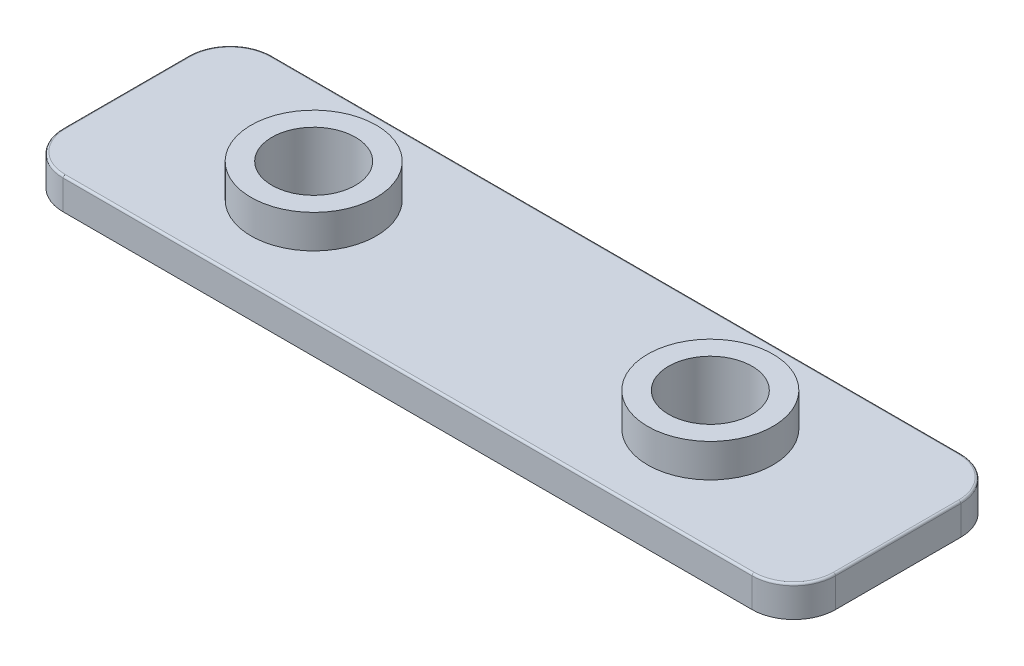
ISO-10303-21;
HEADER;
FILE_DESCRIPTION(('STEP AP214'),'2;1');
FILE_NAME('part.step','',(''),(''),'','','');
FILE_SCHEMA(('AUTOMOTIVE_DESIGN { 1 0 10303 214 1 1 1 1 }'));
ENDSEC;
DATA;
#1=APPLICATION_CONTEXT('core data for automotive mechanical design processes');
#2=APPLICATION_PROTOCOL_DEFINITION('international standard','automotive_design',2000,#1);
#3=PRODUCT_CONTEXT('',#1,'mechanical');
#4=PRODUCT('Part','Part','',(#3));
#5=PRODUCT_RELATED_PRODUCT_CATEGORY('part','',(#4));
#6=PRODUCT_DEFINITION_FORMATION('','',#4);
#7=PRODUCT_DEFINITION_CONTEXT('part definition',#1,'design');
#8=PRODUCT_DEFINITION('design','',#6,#7);
#9=PRODUCT_DEFINITION_SHAPE('','',#8);
#10=(LENGTH_UNIT() NAMED_UNIT(*) SI_UNIT(.MILLI.,.METRE.));
#11=(NAMED_UNIT(*) PLANE_ANGLE_UNIT() SI_UNIT($,.RADIAN.));
#12=(NAMED_UNIT(*) SI_UNIT($,.STERADIAN.) SOLID_ANGLE_UNIT());
#13=UNCERTAINTY_MEASURE_WITH_UNIT(LENGTH_MEASURE(1.E-05),#10,'distance_accuracy_value','');
#14=(GEOMETRIC_REPRESENTATION_CONTEXT(3) GLOBAL_UNCERTAINTY_ASSIGNED_CONTEXT((#13)) GLOBAL_UNIT_ASSIGNED_CONTEXT((#10,
#11,#12)) REPRESENTATION_CONTEXT('',''));
#15=CARTESIAN_POINT('',(0.,0.,0.));
#16=DIRECTION('',(0.,0.,1.));
#17=DIRECTION('',(1.,0.,0.));
#18=AXIS2_PLACEMENT_3D('',#15,#16,#17);
#19=CARTESIAN_POINT('',(18.5,1.5,-5.));
#20=DIRECTION('',(-1.,0.,0.));
#21=DIRECTION('',(0.,0.,1.));
#22=AXIS2_PLACEMENT_3D('',#19,#20,#21);
#23=PLANE('',#22);
#24=DIRECTION('',(0.,-1.,0.));
#25=VECTOR('',#24,1.);
#26=CARTESIAN_POINT('',(18.5,1.5,-3.));
#27=LINE('',#26,#25);
#28=CARTESIAN_POINT('',(18.5,0.,-3.));
#29=VERTEX_POINT('',#28);
#30=CARTESIAN_POINT('',(18.5,1.4,-3.));
#31=VERTEX_POINT('',#30);
#32=EDGE_CURVE('E155',#29,#31,#27,.F.);
#33=ORIENTED_EDGE('',*,*,#32,.T.);
#34=DIRECTION('',(0.,0.,-1.));
#35=VECTOR('',#34,1.);
#36=CARTESIAN_POINT('',(18.5,1.4,3.));
#37=LINE('',#36,#35);
#38=CARTESIAN_POINT('',(18.5,1.4,3.));
#39=VERTEX_POINT('',#38);
#40=EDGE_CURVE('E181',#31,#39,#37,.F.);
#41=ORIENTED_EDGE('',*,*,#40,.T.);
#42=DIRECTION('',(0.,-1.,0.));
#43=VECTOR('',#42,1.);
#44=CARTESIAN_POINT('',(18.5,1.5,3.));
#45=LINE('',#44,#43);
#46=CARTESIAN_POINT('',(18.5,0.,3.));
#47=VERTEX_POINT('',#46);
#48=EDGE_CURVE('E153',#39,#47,#45,.T.);
#49=ORIENTED_EDGE('',*,*,#48,.T.);
#50=DIRECTION('',(0.,0.,-1.));
#51=VECTOR('',#50,1.);
#52=CARTESIAN_POINT('',(18.5,0.,-5.));
#53=LINE('',#52,#51);
#54=EDGE_CURVE('E138',#47,#29,#53,.T.);
#55=ORIENTED_EDGE('',*,*,#54,.T.);
#56=EDGE_LOOP('',(#33,#41,#49,#55));
#57=FACE_BOUND('',#56,.T.);
#58=ADVANCED_FACE('F16',(#57),#23,.F.);
#59=CARTESIAN_POINT('',(-18.5,1.5,-5.));
#60=DIRECTION('',(0.,0.,1.));
#61=DIRECTION('',(1.,0.,0.));
#62=AXIS2_PLACEMENT_3D('',#59,#60,#61);
#63=PLANE('',#62);
#64=DIRECTION('',(0.,-1.,0.));
#65=VECTOR('',#64,1.);
#66=CARTESIAN_POINT('',(-16.5,1.5,-5.));
#67=LINE('',#66,#65);
#68=CARTESIAN_POINT('',(-16.5,0.,-5.));
#69=VERTEX_POINT('',#68);
#70=CARTESIAN_POINT('',(-16.5,1.4,-5.));
#71=VERTEX_POINT('',#70);
#72=EDGE_CURVE('E123',#69,#71,#67,.F.);
#73=ORIENTED_EDGE('',*,*,#72,.T.);
#74=DIRECTION('',(-1.,0.,0.));
#75=VECTOR('',#74,1.);
#76=CARTESIAN_POINT('',(16.5,1.4,-5.));
#77=LINE('',#76,#75);
#78=CARTESIAN_POINT('',(16.5,1.4,-5.));
#79=VERTEX_POINT('',#78);
#80=EDGE_CURVE('E177',#71,#79,#77,.F.);
#81=ORIENTED_EDGE('',*,*,#80,.T.);
#82=DIRECTION('',(0.,-1.,0.));
#83=VECTOR('',#82,1.);
#84=CARTESIAN_POINT('',(16.5,1.5,-5.));
#85=LINE('',#84,#83);
#86=CARTESIAN_POINT('',(16.5,0.,-5.));
#87=VERTEX_POINT('',#86);
#88=EDGE_CURVE('E127',#79,#87,#85,.T.);
#89=ORIENTED_EDGE('',*,*,#88,.T.);
#90=DIRECTION('',(-1.,0.,0.));
#91=VECTOR('',#90,1.);
#92=CARTESIAN_POINT('',(-18.5,0.,-5.));
#93=LINE('',#92,#91);
#94=EDGE_CURVE('E134',#87,#69,#93,.T.);
#95=ORIENTED_EDGE('',*,*,#94,.T.);
#96=EDGE_LOOP('',(#73,#81,#89,#95));
#97=FACE_BOUND('',#96,.T.);
#98=ADVANCED_FACE('F280',(#97),#63,.F.);
#99=CARTESIAN_POINT('',(-18.5,1.5,-5.));
#100=DIRECTION('',(1.,0.,0.));
#101=DIRECTION('',(0.,0.,-1.));
#102=AXIS2_PLACEMENT_3D('',#99,#100,#101);
#103=PLANE('',#102);
#104=DIRECTION('',(0.,-1.,0.));
#105=VECTOR('',#104,1.);
#106=CARTESIAN_POINT('',(-18.5,1.5,3.));
#107=LINE('',#106,#105);
#108=CARTESIAN_POINT('',(-18.5,0.,3.));
#109=VERTEX_POINT('',#108);
#110=CARTESIAN_POINT('',(-18.5,1.4,3.));
#111=VERTEX_POINT('',#110);
#112=EDGE_CURVE('E117',#109,#111,#107,.F.);
#113=ORIENTED_EDGE('',*,*,#112,.T.);
#114=DIRECTION('',(0.,0.,1.));
#115=VECTOR('',#114,1.);
#116=CARTESIAN_POINT('',(-18.5,1.4,-3.));
#117=LINE('',#116,#115);
#118=CARTESIAN_POINT('',(-18.5,1.4,-3.));
#119=VERTEX_POINT('',#118);
#120=EDGE_CURVE('E10',#111,#119,#117,.F.);
#121=ORIENTED_EDGE('',*,*,#120,.T.);
#122=DIRECTION('',(0.,-1.,0.));
#123=VECTOR('',#122,1.);
#124=CARTESIAN_POINT('',(-18.5,1.5,-3.));
#125=LINE('',#124,#123);
#126=CARTESIAN_POINT('',(-18.5,0.,-3.));
#127=VERTEX_POINT('',#126);
#128=EDGE_CURVE('E107',#119,#127,#125,.T.);
#129=ORIENTED_EDGE('',*,*,#128,.T.);
#130=DIRECTION('',(0.,0.,1.));
#131=VECTOR('',#130,1.);
#132=CARTESIAN_POINT('',(-18.5,0.,-5.));
#133=LINE('',#132,#131);
#134=EDGE_CURVE('E111',#127,#109,#133,.T.);
#135=ORIENTED_EDGE('',*,*,#134,.T.);
#136=EDGE_LOOP('',(#113,#121,#129,#135));
#137=FACE_BOUND('',#136,.T.);
#138=ADVANCED_FACE('F109',(#137),#103,.F.);
#139=CARTESIAN_POINT('',(-18.5,1.5,5.));
#140=DIRECTION('',(0.,0.,-1.));
#141=DIRECTION('',(-1.,0.,0.));
#142=AXIS2_PLACEMENT_3D('',#139,#140,#141);
#143=PLANE('',#142);
#144=DIRECTION('',(0.,-1.,0.));
#145=VECTOR('',#144,1.);
#146=CARTESIAN_POINT('',(16.5,1.5,5.));
#147=LINE('',#146,#145);
#148=CARTESIAN_POINT('',(16.5,0.,5.));
#149=VERTEX_POINT('',#148);
#150=CARTESIAN_POINT('',(16.5,1.4,5.));
#151=VERTEX_POINT('',#150);
#152=EDGE_CURVE('E149',#149,#151,#147,.F.);
#153=ORIENTED_EDGE('',*,*,#152,.T.);
#154=DIRECTION('',(1.,0.,0.));
#155=VECTOR('',#154,1.);
#156=CARTESIAN_POINT('',(-16.5,1.4,5.));
#157=LINE('',#156,#155);
#158=CARTESIAN_POINT('',(-16.5,1.4,5.));
#159=VERTEX_POINT('',#158);
#160=EDGE_CURVE('E40',#151,#159,#157,.F.);
#161=ORIENTED_EDGE('',*,*,#160,.T.);
#162=DIRECTION('',(0.,-1.,0.));
#163=VECTOR('',#162,1.);
#164=CARTESIAN_POINT('',(-16.5,1.5,5.));
#165=LINE('',#164,#163);
#166=CARTESIAN_POINT('',(-16.5,0.,5.));
#167=VERTEX_POINT('',#166);
#168=EDGE_CURVE('E151',#159,#167,#165,.T.);
#169=ORIENTED_EDGE('',*,*,#168,.T.);
#170=DIRECTION('',(1.,0.,0.));
#171=VECTOR('',#170,1.);
#172=CARTESIAN_POINT('',(-18.5,0.,5.));
#173=LINE('',#172,#171);
#174=EDGE_CURVE('E133',#167,#149,#173,.T.);
#175=ORIENTED_EDGE('',*,*,#174,.T.);
#176=EDGE_LOOP('',(#153,#161,#169,#175));
#177=FACE_BOUND('',#176,.T.);
#178=ADVANCED_FACE('F288',(#177),#143,.F.);
#179=CARTESIAN_POINT('',(0.,1.5,0.));
#180=DIRECTION('',(0.,1.,0.));
#181=DIRECTION('',(0.,0.,1.));
#182=AXIS2_PLACEMENT_3D('',#179,#180,#181);
#183=PLANE('',#182);
#184=DIRECTION('',(-1.,0.,0.));
#185=VECTOR('',#184,1.);
#186=CARTESIAN_POINT('',(-16.5,1.5,-4.9));
#187=LINE('',#186,#185);
#188=CARTESIAN_POINT('',(16.5,1.5,-4.9));
#189=VERTEX_POINT('',#188);
#190=CARTESIAN_POINT('',(-16.5,1.5,-4.9));
#191=VERTEX_POINT('',#190);
#192=EDGE_CURVE('E170',#189,#191,#187,.T.);
#193=ORIENTED_EDGE('',*,*,#192,.T.);
#194=CARTESIAN_POINT('',(-16.5,1.5,-3.));
#195=DIRECTION('',(0.,1.,0.));
#196=DIRECTION('',(0.,0.,1.));
#197=AXIS2_PLACEMENT_3D('',#194,#195,#196);
#198=CIRCLE('',#197,1.9);
#199=CARTESIAN_POINT('',(-18.4,1.5,-3.));
#200=VERTEX_POINT('',#199);
#201=EDGE_CURVE('E172',#191,#200,#198,.T.);
#202=ORIENTED_EDGE('',*,*,#201,.T.);
#203=DIRECTION('',(0.,0.,1.));
#204=VECTOR('',#203,1.);
#205=CARTESIAN_POINT('',(-18.4,1.5,3.));
#206=LINE('',#205,#204);
#207=CARTESIAN_POINT('',(-18.4,1.5,3.));
#208=VERTEX_POINT('',#207);
#209=EDGE_CURVE('E158',#200,#208,#206,.T.);
#210=ORIENTED_EDGE('',*,*,#209,.T.);
#211=CARTESIAN_POINT('',(-16.5,1.5,3.));
#212=DIRECTION('',(0.,1.,0.));
#213=DIRECTION('',(0.,0.,1.));
#214=AXIS2_PLACEMENT_3D('',#211,#212,#213);
#215=CIRCLE('',#214,1.9);
#216=CARTESIAN_POINT('',(-16.5,1.5,4.9));
#217=VERTEX_POINT('',#216);
#218=EDGE_CURVE('E160',#208,#217,#215,.T.);
#219=ORIENTED_EDGE('',*,*,#218,.T.);
#220=DIRECTION('',(1.,0.,0.));
#221=VECTOR('',#220,1.);
#222=CARTESIAN_POINT('',(16.5,1.5,4.9));
#223=LINE('',#222,#221);
#224=CARTESIAN_POINT('',(16.5,1.5,4.9));
#225=VERTEX_POINT('',#224);
#226=EDGE_CURVE('E162',#217,#225,#223,.T.);
#227=ORIENTED_EDGE('',*,*,#226,.T.);
#228=CARTESIAN_POINT('',(16.5,1.5,3.));
#229=DIRECTION('',(0.,1.,0.));
#230=DIRECTION('',(0.,0.,1.));
#231=AXIS2_PLACEMENT_3D('',#228,#229,#230);
#232=CIRCLE('',#231,1.9);
#233=CARTESIAN_POINT('',(18.4,1.5,3.));
#234=VERTEX_POINT('',#233);
#235=EDGE_CURVE('E164',#225,#234,#232,.T.);
#236=ORIENTED_EDGE('',*,*,#235,.T.);
#237=DIRECTION('',(0.,0.,-1.));
#238=VECTOR('',#237,1.);
#239=CARTESIAN_POINT('',(18.4,1.5,-3.));
#240=LINE('',#239,#238);
#241=CARTESIAN_POINT('',(18.4,1.5,-3.));
#242=VERTEX_POINT('',#241);
#243=EDGE_CURVE('E166',#234,#242,#240,.T.);
#244=ORIENTED_EDGE('',*,*,#243,.T.);
#245=CARTESIAN_POINT('',(16.5,1.5,-3.));
#246=DIRECTION('',(0.,1.,0.));
#247=DIRECTION('',(0.,0.,1.));
#248=AXIS2_PLACEMENT_3D('',#245,#246,#247);
#249=CIRCLE('',#248,1.9);
#250=EDGE_CURVE('E168',#242,#189,#249,.T.);
#251=ORIENTED_EDGE('',*,*,#250,.T.);
#252=EDGE_LOOP('',(#193,#202,#210,#219,#227,#236,#244,#251));
#253=FACE_BOUND('',#252,.T.);
#254=CARTESIAN_POINT('',(-9.5,1.5,0.));
#255=DIRECTION('',(0.,1.,0.));
#256=DIRECTION('',(0.,0.,-1.));
#257=AXIS2_PLACEMENT_3D('',#254,#255,#256);
#258=CIRCLE('',#257,3.);
#259=CARTESIAN_POINT('',(-9.5,1.5,-3.));
#260=VERTEX_POINT('',#259);
#261=EDGE_CURVE('E227',#260,#260,#258,.T.);
#262=ORIENTED_EDGE('',*,*,#261,.F.);
#263=EDGE_LOOP('',(#262));
#264=FACE_BOUND('',#263,.T.);
#265=CARTESIAN_POINT('',(9.5,1.5,0.));
#266=DIRECTION('',(0.,1.,0.));
#267=DIRECTION('',(0.,0.,1.));
#268=AXIS2_PLACEMENT_3D('',#265,#266,#267);
#269=CIRCLE('',#268,3.);
#270=CARTESIAN_POINT('',(9.5,1.5,3.));
#271=VERTEX_POINT('',#270);
#272=EDGE_CURVE('E226',#271,#271,#269,.T.);
#273=ORIENTED_EDGE('',*,*,#272,.F.);
#274=EDGE_LOOP('',(#273));
#275=FACE_BOUND('',#274,.T.);
#276=ADVANCED_FACE('F258',(#253,#264,#275),#183,.T.);
#277=CARTESIAN_POINT('',(0.,0.,0.));
#278=DIRECTION('',(0.,1.,0.));
#279=DIRECTION('',(0.,0.,1.));
#280=AXIS2_PLACEMENT_3D('',#277,#278,#279);
#281=PLANE('',#280);
#282=CARTESIAN_POINT('',(-9.5,0.,0.));
#283=DIRECTION('',(0.,-1.,0.));
#284=DIRECTION('',(0.,0.,-1.));
#285=AXIS2_PLACEMENT_3D('',#282,#283,#284);
#286=CIRCLE('',#285,2.);
#287=CARTESIAN_POINT('',(-9.5,0.,-2.));
#288=VERTEX_POINT('',#287);
#289=EDGE_CURVE('E219',#288,#288,#286,.T.);
#290=ORIENTED_EDGE('',*,*,#289,.F.);
#291=EDGE_LOOP('',(#290));
#292=FACE_BOUND('',#291,.T.);
#293=CARTESIAN_POINT('',(9.5,0.,0.));
#294=DIRECTION('',(0.,-1.,0.));
#295=DIRECTION('',(0.,0.,1.));
#296=AXIS2_PLACEMENT_3D('',#293,#294,#295);
#297=CIRCLE('',#296,2.);
#298=CARTESIAN_POINT('',(9.5,0.,2.));
#299=VERTEX_POINT('',#298);
#300=EDGE_CURVE('E208',#299,#299,#297,.T.);
#301=ORIENTED_EDGE('',*,*,#300,.F.);
#302=EDGE_LOOP('',(#301));
#303=FACE_BOUND('',#302,.T.);
#304=ORIENTED_EDGE('',*,*,#134,.F.);
#305=CARTESIAN_POINT('',(-16.5,0.,-3.));
#306=DIRECTION('',(0.,1.,0.));
#307=DIRECTION('',(0.,0.,1.));
#308=AXIS2_PLACEMENT_3D('',#305,#306,#307);
#309=CIRCLE('',#308,2.);
#310=EDGE_CURVE('E120',#127,#69,#309,.F.);
#311=ORIENTED_EDGE('',*,*,#310,.T.);
#312=ORIENTED_EDGE('',*,*,#94,.F.);
#313=CARTESIAN_POINT('',(16.5,0.,-3.));
#314=DIRECTION('',(0.,1.,0.));
#315=DIRECTION('',(0.,0.,1.));
#316=AXIS2_PLACEMENT_3D('',#313,#314,#315);
#317=CIRCLE('',#316,2.);
#318=EDGE_CURVE('E144',#87,#29,#317,.F.);
#319=ORIENTED_EDGE('',*,*,#318,.T.);
#320=ORIENTED_EDGE('',*,*,#54,.F.);
#321=CARTESIAN_POINT('',(16.5,0.,3.));
#322=DIRECTION('',(0.,1.,0.));
#323=DIRECTION('',(0.,0.,1.));
#324=AXIS2_PLACEMENT_3D('',#321,#322,#323);
#325=CIRCLE('',#324,2.);
#326=EDGE_CURVE('E116',#47,#149,#325,.F.);
#327=ORIENTED_EDGE('',*,*,#326,.T.);
#328=ORIENTED_EDGE('',*,*,#174,.F.);
#329=CARTESIAN_POINT('',(-16.5,0.,3.));
#330=DIRECTION('',(0.,1.,0.));
#331=DIRECTION('',(0.,0.,1.));
#332=AXIS2_PLACEMENT_3D('',#329,#330,#331);
#333=CIRCLE('',#332,2.);
#334=EDGE_CURVE('E128',#167,#109,#333,.F.);
#335=ORIENTED_EDGE('',*,*,#334,.T.);
#336=EDGE_LOOP('',(#304,#311,#312,#319,#320,#327,#328,#335));
#337=FACE_BOUND('',#336,.T.);
#338=ADVANCED_FACE('F130',(#292,#303,#337),#281,.F.);
#339=CARTESIAN_POINT('',(9.5,3.1,0.));
#340=DIRECTION('',(0.,-1.,0.));
#341=DIRECTION('',(0.,0.,-1.));
#342=AXIS2_PLACEMENT_3D('',#339,#340,#341);
#343=CYLINDRICAL_SURFACE('',#342,3.);
#344=CARTESIAN_POINT('',(9.5,3.1,0.));
#345=DIRECTION('',(0.,1.,0.));
#346=DIRECTION('',(0.,0.,1.));
#347=AXIS2_PLACEMENT_3D('',#344,#345,#346);
#348=CIRCLE('',#347,3.);
#349=CARTESIAN_POINT('',(9.5,3.1,3.));
#350=VERTEX_POINT('',#349);
#351=EDGE_CURVE('E231',#350,#350,#348,.T.);
#352=ORIENTED_EDGE('',*,*,#351,.F.);
#353=EDGE_LOOP('',(#352));
#354=FACE_BOUND('',#353,.T.);
#355=ORIENTED_EDGE('',*,*,#272,.T.);
#356=EDGE_LOOP('',(#355));
#357=FACE_BOUND('',#356,.T.);
#358=ADVANCED_FACE('F342',(#354,#357),#343,.T.);
#359=CARTESIAN_POINT('',(9.5,3.1,0.));
#360=DIRECTION('',(0.,1.,0.));
#361=DIRECTION('',(0.,0.,1.));
#362=AXIS2_PLACEMENT_3D('',#359,#360,#361);
#363=PLANE('',#362);
#364=CARTESIAN_POINT('',(9.5,3.1,0.));
#365=DIRECTION('',(0.,-1.,0.));
#366=DIRECTION('',(0.,0.,1.));
#367=AXIS2_PLACEMENT_3D('',#364,#365,#366);
#368=CIRCLE('',#367,2.);
#369=CARTESIAN_POINT('',(9.5,3.1,2.));
#370=VERTEX_POINT('',#369);
#371=EDGE_CURVE('E214',#370,#370,#368,.T.);
#372=ORIENTED_EDGE('',*,*,#371,.T.);
#373=EDGE_LOOP('',(#372));
#374=FACE_BOUND('',#373,.T.);
#375=ORIENTED_EDGE('',*,*,#351,.T.);
#376=EDGE_LOOP('',(#375));
#377=FACE_BOUND('',#376,.T.);
#378=ADVANCED_FACE('F338',(#374,#377),#363,.T.);
#379=CARTESIAN_POINT('',(-9.5,3.1,0.));
#380=DIRECTION('',(0.,-1.,0.));
#381=DIRECTION('',(0.,0.,-1.));
#382=AXIS2_PLACEMENT_3D('',#379,#380,#381);
#383=CYLINDRICAL_SURFACE('',#382,3.);
#384=CARTESIAN_POINT('',(-9.5,3.1,0.));
#385=DIRECTION('',(0.,1.,0.));
#386=DIRECTION('',(0.,0.,-1.));
#387=AXIS2_PLACEMENT_3D('',#384,#385,#386);
#388=CIRCLE('',#387,3.);
#389=CARTESIAN_POINT('',(-9.5,3.1,-3.));
#390=VERTEX_POINT('',#389);
#391=EDGE_CURVE('E223',#390,#390,#388,.T.);
#392=ORIENTED_EDGE('',*,*,#391,.F.);
#393=EDGE_LOOP('',(#392));
#394=FACE_BOUND('',#393,.T.);
#395=ORIENTED_EDGE('',*,*,#261,.T.);
#396=EDGE_LOOP('',(#395));
#397=FACE_BOUND('',#396,.T.);
#398=ADVANCED_FACE('F334',(#394,#397),#383,.T.);
#399=CARTESIAN_POINT('',(-9.5,3.1,0.));
#400=DIRECTION('',(0.,-1.,0.));
#401=DIRECTION('',(0.,0.,-1.));
#402=AXIS2_PLACEMENT_3D('',#399,#400,#401);
#403=PLANE('',#402);
#404=CARTESIAN_POINT('',(-9.5,3.1,0.));
#405=DIRECTION('',(0.,-1.,0.));
#406=DIRECTION('',(0.,0.,-1.));
#407=AXIS2_PLACEMENT_3D('',#404,#405,#406);
#408=CIRCLE('',#407,2.);
#409=CARTESIAN_POINT('',(-9.5,3.1,-2.));
#410=VERTEX_POINT('',#409);
#411=EDGE_CURVE('E230',#410,#410,#408,.T.);
#412=ORIENTED_EDGE('',*,*,#411,.T.);
#413=EDGE_LOOP('',(#412));
#414=FACE_BOUND('',#413,.T.);
#415=ORIENTED_EDGE('',*,*,#391,.T.);
#416=EDGE_LOOP('',(#415));
#417=FACE_BOUND('',#416,.T.);
#418=ADVANCED_FACE('F296',(#414,#417),#403,.F.);
#419=CARTESIAN_POINT('',(-16.5,1.5,-3.));
#420=DIRECTION('',(0.,-1.,0.));
#421=DIRECTION('',(0.,0.,-1.));
#422=AXIS2_PLACEMENT_3D('',#419,#420,#421);
#423=CYLINDRICAL_SURFACE('',#422,2.);
#424=ORIENTED_EDGE('',*,*,#128,.F.);
#425=CARTESIAN_POINT('',(-16.5,1.4,-3.));
#426=DIRECTION('',(0.,1.,0.));
#427=DIRECTION('',(0.,0.,1.));
#428=AXIS2_PLACEMENT_3D('',#425,#426,#427);
#429=CIRCLE('',#428,2.);
#430=EDGE_CURVE('E175',#119,#71,#429,.F.);
#431=ORIENTED_EDGE('',*,*,#430,.T.);
#432=ORIENTED_EDGE('',*,*,#72,.F.);
#433=ORIENTED_EDGE('',*,*,#310,.F.);
#434=EDGE_LOOP('',(#424,#431,#432,#433));
#435=FACE_BOUND('',#434,.T.);
#436=ADVANCED_FACE('F121',(#435),#423,.T.);
#437=CARTESIAN_POINT('',(-16.5,1.5,3.));
#438=DIRECTION('',(0.,-1.,0.));
#439=DIRECTION('',(0.,0.,-1.));
#440=AXIS2_PLACEMENT_3D('',#437,#438,#439);
#441=CYLINDRICAL_SURFACE('',#440,2.);
#442=ORIENTED_EDGE('',*,*,#168,.F.);
#443=CARTESIAN_POINT('',(-16.5,1.4,3.));
#444=DIRECTION('',(0.,1.,0.));
#445=DIRECTION('',(0.,0.,1.));
#446=AXIS2_PLACEMENT_3D('',#443,#444,#445);
#447=CIRCLE('',#446,2.);
#448=EDGE_CURVE('E25',#159,#111,#447,.F.);
#449=ORIENTED_EDGE('',*,*,#448,.T.);
#450=ORIENTED_EDGE('',*,*,#112,.F.);
#451=ORIENTED_EDGE('',*,*,#334,.F.);
#452=EDGE_LOOP('',(#442,#449,#450,#451));
#453=FACE_BOUND('',#452,.T.);
#454=ADVANCED_FACE('F295',(#453),#441,.T.);
#455=CARTESIAN_POINT('',(16.5,1.5,-3.));
#456=DIRECTION('',(0.,-1.,0.));
#457=DIRECTION('',(0.,0.,-1.));
#458=AXIS2_PLACEMENT_3D('',#455,#456,#457);
#459=CYLINDRICAL_SURFACE('',#458,2.);
#460=ORIENTED_EDGE('',*,*,#88,.F.);
#461=CARTESIAN_POINT('',(16.5,1.4,-3.));
#462=DIRECTION('',(0.,1.,0.));
#463=DIRECTION('',(0.,0.,1.));
#464=AXIS2_PLACEMENT_3D('',#461,#462,#463);
#465=CIRCLE('',#464,2.);
#466=EDGE_CURVE('E179',#79,#31,#465,.F.);
#467=ORIENTED_EDGE('',*,*,#466,.T.);
#468=ORIENTED_EDGE('',*,*,#32,.F.);
#469=ORIENTED_EDGE('',*,*,#318,.F.);
#470=EDGE_LOOP('',(#460,#467,#468,#469));
#471=FACE_BOUND('',#470,.T.);
#472=ADVANCED_FACE('F244',(#471),#459,.T.);
#473=CARTESIAN_POINT('',(16.5,1.5,3.));
#474=DIRECTION('',(0.,-1.,0.));
#475=DIRECTION('',(0.,0.,-1.));
#476=AXIS2_PLACEMENT_3D('',#473,#474,#475);
#477=CYLINDRICAL_SURFACE('',#476,2.);
#478=ORIENTED_EDGE('',*,*,#48,.F.);
#479=CARTESIAN_POINT('',(16.5,1.4,3.));
#480=DIRECTION('',(0.,1.,0.));
#481=DIRECTION('',(0.,0.,1.));
#482=AXIS2_PLACEMENT_3D('',#479,#480,#481);
#483=CIRCLE('',#482,2.);
#484=EDGE_CURVE('E183',#39,#151,#483,.F.);
#485=ORIENTED_EDGE('',*,*,#484,.T.);
#486=ORIENTED_EDGE('',*,*,#152,.F.);
#487=ORIENTED_EDGE('',*,*,#326,.F.);
#488=EDGE_LOOP('',(#478,#485,#486,#487));
#489=FACE_BOUND('',#488,.T.);
#490=ADVANCED_FACE('F264',(#489),#477,.T.);
#491=CARTESIAN_POINT('',(-9.5,3.1,0.));
#492=DIRECTION('',(0.,-1.,0.));
#493=DIRECTION('',(0.,0.,-1.));
#494=AXIS2_PLACEMENT_3D('',#491,#492,#493);
#495=CYLINDRICAL_SURFACE('',#494,2.);
#496=ORIENTED_EDGE('',*,*,#411,.F.);
#497=EDGE_LOOP('',(#496));
#498=FACE_BOUND('',#497,.T.);
#499=ORIENTED_EDGE('',*,*,#289,.T.);
#500=EDGE_LOOP('',(#499));
#501=FACE_BOUND('',#500,.T.);
#502=ADVANCED_FACE('F303',(#498,#501),#495,.F.);
#503=CARTESIAN_POINT('',(9.5,3.1,0.));
#504=DIRECTION('',(0.,-1.,0.));
#505=DIRECTION('',(0.,0.,-1.));
#506=AXIS2_PLACEMENT_3D('',#503,#504,#505);
#507=CYLINDRICAL_SURFACE('',#506,2.);
#508=ORIENTED_EDGE('',*,*,#371,.F.);
#509=EDGE_LOOP('',(#508));
#510=FACE_BOUND('',#509,.T.);
#511=ORIENTED_EDGE('',*,*,#300,.T.);
#512=EDGE_LOOP('',(#511));
#513=FACE_BOUND('',#512,.T.);
#514=ADVANCED_FACE('F319',(#510,#513),#507,.F.);
#515=CARTESIAN_POINT('',(16.5,1.4,3.));
#516=DIRECTION('',(0.,1.,0.));
#517=DIRECTION('',(0.,0.,1.));
#518=AXIS2_PLACEMENT_3D('',#515,#516,#517);
#519=TOROIDAL_SURFACE('',#518,1.9,0.1);
#520=CARTESIAN_POINT('',(16.5,1.4,4.9));
#521=DIRECTION('',(-1.,0.,0.));
#522=DIRECTION('',(0.,0.,1.));
#523=AXIS2_PLACEMENT_3D('',#520,#521,#522);
#524=CIRCLE('',#523,0.1);
#525=EDGE_CURVE('E202',#151,#225,#524,.T.);
#526=ORIENTED_EDGE('',*,*,#525,.F.);
#527=ORIENTED_EDGE('',*,*,#484,.F.);
#528=CARTESIAN_POINT('',(18.4,1.4,3.));
#529=DIRECTION('',(0.,0.,-1.));
#530=DIRECTION('',(-1.,0.,0.));
#531=AXIS2_PLACEMENT_3D('',#528,#529,#530);
#532=CIRCLE('',#531,0.1);
#533=EDGE_CURVE('E20',#234,#39,#532,.T.);
#534=ORIENTED_EDGE('',*,*,#533,.F.);
#535=ORIENTED_EDGE('',*,*,#235,.F.);
#536=EDGE_LOOP('',(#526,#527,#534,#535));
#537=FACE_BOUND('',#536,.T.);
#538=ADVANCED_FACE('F18',(#537),#519,.T.);
#539=CARTESIAN_POINT('',(18.4,1.4,0.));
#540=DIRECTION('',(0.,0.,1.));
#541=DIRECTION('',(1.,0.,0.));
#542=AXIS2_PLACEMENT_3D('',#539,#540,#541);
#543=CYLINDRICAL_SURFACE('',#542,0.1);
#544=ORIENTED_EDGE('',*,*,#533,.T.);
#545=ORIENTED_EDGE('',*,*,#40,.F.);
#546=CARTESIAN_POINT('',(18.4,1.4,-3.));
#547=DIRECTION('',(0.,0.,-1.));
#548=DIRECTION('',(-1.,0.,0.));
#549=AXIS2_PLACEMENT_3D('',#546,#547,#548);
#550=CIRCLE('',#549,0.1);
#551=EDGE_CURVE('E200',#242,#31,#550,.T.);
#552=ORIENTED_EDGE('',*,*,#551,.F.);
#553=ORIENTED_EDGE('',*,*,#243,.F.);
#554=EDGE_LOOP('',(#544,#545,#552,#553));
#555=FACE_BOUND('',#554,.T.);
#556=ADVANCED_FACE('F261',(#555),#543,.T.);
#557=CARTESIAN_POINT('',(0.,1.4,4.9));
#558=DIRECTION('',(-1.,0.,0.));
#559=DIRECTION('',(0.,0.,1.));
#560=AXIS2_PLACEMENT_3D('',#557,#558,#559);
#561=CYLINDRICAL_SURFACE('',#560,0.1);
#562=ORIENTED_EDGE('',*,*,#525,.T.);
#563=ORIENTED_EDGE('',*,*,#226,.F.);
#564=CARTESIAN_POINT('',(-16.5,1.4,4.9));
#565=DIRECTION('',(-1.,0.,0.));
#566=DIRECTION('',(0.,0.,1.));
#567=AXIS2_PLACEMENT_3D('',#564,#565,#566);
#568=CIRCLE('',#567,0.1);
#569=EDGE_CURVE('E197',#159,#217,#568,.T.);
#570=ORIENTED_EDGE('',*,*,#569,.F.);
#571=ORIENTED_EDGE('',*,*,#160,.F.);
#572=EDGE_LOOP('',(#562,#563,#570,#571));
#573=FACE_BOUND('',#572,.T.);
#574=ADVANCED_FACE('F268',(#573),#561,.T.);
#575=CARTESIAN_POINT('',(16.5,1.4,-3.));
#576=DIRECTION('',(0.,1.,0.));
#577=DIRECTION('',(0.,0.,1.));
#578=AXIS2_PLACEMENT_3D('',#575,#576,#577);
#579=TOROIDAL_SURFACE('',#578,1.9,0.1);
#580=ORIENTED_EDGE('',*,*,#551,.T.);
#581=ORIENTED_EDGE('',*,*,#466,.F.);
#582=CARTESIAN_POINT('',(16.5,1.4,-4.9));
#583=DIRECTION('',(-1.,0.,0.));
#584=DIRECTION('',(0.,0.,1.));
#585=AXIS2_PLACEMENT_3D('',#582,#583,#584);
#586=CIRCLE('',#585,0.1);
#587=EDGE_CURVE('E194',#189,#79,#586,.T.);
#588=ORIENTED_EDGE('',*,*,#587,.F.);
#589=ORIENTED_EDGE('',*,*,#250,.F.);
#590=EDGE_LOOP('',(#580,#581,#588,#589));
#591=FACE_BOUND('',#590,.T.);
#592=ADVANCED_FACE('F248',(#591),#579,.T.);
#593=CARTESIAN_POINT('',(-16.5,1.4,3.));
#594=DIRECTION('',(0.,1.,0.));
#595=DIRECTION('',(0.,0.,1.));
#596=AXIS2_PLACEMENT_3D('',#593,#594,#595);
#597=TOROIDAL_SURFACE('',#596,1.9,0.1);
#598=ORIENTED_EDGE('',*,*,#569,.T.);
#599=ORIENTED_EDGE('',*,*,#218,.F.);
#600=CARTESIAN_POINT('',(-18.4,1.4,3.));
#601=DIRECTION('',(0.,0.,-1.));
#602=DIRECTION('',(-1.,0.,0.));
#603=AXIS2_PLACEMENT_3D('',#600,#601,#602);
#604=CIRCLE('',#603,0.1);
#605=EDGE_CURVE('E191',#111,#208,#604,.T.);
#606=ORIENTED_EDGE('',*,*,#605,.F.);
#607=ORIENTED_EDGE('',*,*,#448,.F.);
#608=EDGE_LOOP('',(#598,#599,#606,#607));
#609=FACE_BOUND('',#608,.T.);
#610=ADVANCED_FACE('F272',(#609),#597,.T.);
#611=CARTESIAN_POINT('',(0.,1.4,-4.9));
#612=DIRECTION('',(1.,0.,0.));
#613=DIRECTION('',(0.,0.,-1.));
#614=AXIS2_PLACEMENT_3D('',#611,#612,#613);
#615=CYLINDRICAL_SURFACE('',#614,0.1);
#616=ORIENTED_EDGE('',*,*,#587,.T.);
#617=ORIENTED_EDGE('',*,*,#80,.F.);
#618=CARTESIAN_POINT('',(-16.5,1.4,-4.9));
#619=DIRECTION('',(-1.,0.,0.));
#620=DIRECTION('',(0.,0.,1.));
#621=AXIS2_PLACEMENT_3D('',#618,#619,#620);
#622=CIRCLE('',#621,0.1);
#623=EDGE_CURVE('E189',#191,#71,#622,.T.);
#624=ORIENTED_EDGE('',*,*,#623,.F.);
#625=ORIENTED_EDGE('',*,*,#192,.F.);
#626=EDGE_LOOP('',(#616,#617,#624,#625));
#627=FACE_BOUND('',#626,.T.);
#628=ADVANCED_FACE('F254',(#627),#615,.T.);
#629=CARTESIAN_POINT('',(-18.4,1.4,0.));
#630=DIRECTION('',(0.,0.,-1.));
#631=DIRECTION('',(-1.,0.,0.));
#632=AXIS2_PLACEMENT_3D('',#629,#630,#631);
#633=CYLINDRICAL_SURFACE('',#632,0.1);
#634=ORIENTED_EDGE('',*,*,#605,.T.);
#635=ORIENTED_EDGE('',*,*,#209,.F.);
#636=CARTESIAN_POINT('',(-18.4,1.4,-3.));
#637=DIRECTION('',(0.,0.,-1.));
#638=DIRECTION('',(-1.,0.,0.));
#639=AXIS2_PLACEMENT_3D('',#636,#637,#638);
#640=CIRCLE('',#639,0.1);
#641=EDGE_CURVE('E187',#119,#200,#640,.T.);
#642=ORIENTED_EDGE('',*,*,#641,.F.);
#643=ORIENTED_EDGE('',*,*,#120,.F.);
#644=EDGE_LOOP('',(#634,#635,#642,#643));
#645=FACE_BOUND('',#644,.T.);
#646=ADVANCED_FACE('F276',(#645),#633,.T.);
#647=CARTESIAN_POINT('',(-16.5,1.4,-3.));
#648=DIRECTION('',(0.,1.,0.));
#649=DIRECTION('',(0.,0.,1.));
#650=AXIS2_PLACEMENT_3D('',#647,#648,#649);
#651=TOROIDAL_SURFACE('',#650,1.9,0.1);
#652=ORIENTED_EDGE('',*,*,#623,.T.);
#653=ORIENTED_EDGE('',*,*,#430,.F.);
#654=ORIENTED_EDGE('',*,*,#641,.T.);
#655=ORIENTED_EDGE('',*,*,#201,.F.);
#656=EDGE_LOOP('',(#652,#653,#654,#655));
#657=FACE_BOUND('',#656,.T.);
#658=ADVANCED_FACE('F278',(#657),#651,.T.);
#659=CLOSED_SHELL('',(#58,#98,#138,#178,#276,#338,#358,#378,#398,#418,#436,#454,#472,#490,#502,
#514,#538,#556,#574,#592,#610,#628,#646,#658));
#660=MANIFOLD_SOLID_BREP('B1',#659);
#661=ADVANCED_BREP_SHAPE_REPRESENTATION('',(#18,#660),#14);
#662=SHAPE_DEFINITION_REPRESENTATION(#9,#661);
ENDSEC;
END-ISO-10303-21;
